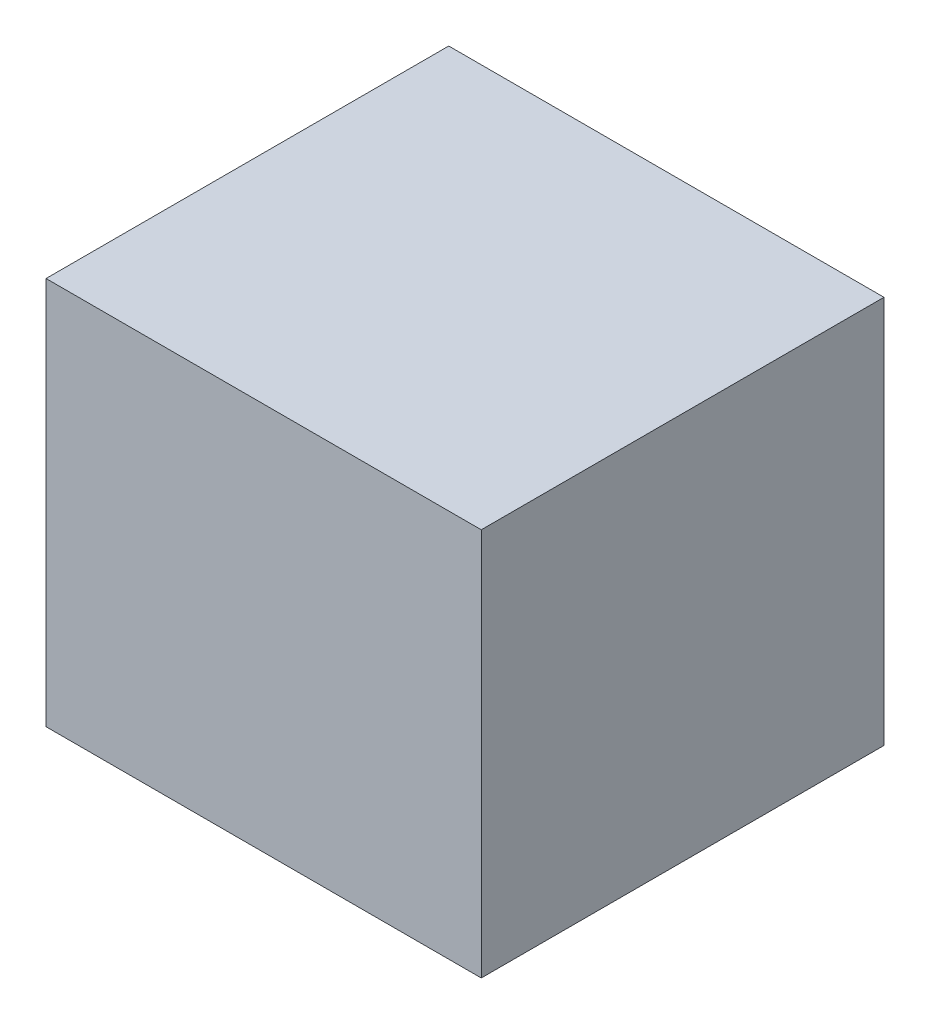
ISO-10303-21;
HEADER;
FILE_DESCRIPTION(('STEP AP214'),'2;1');
FILE_NAME('part.step','',(''),(''),'','','');
FILE_SCHEMA(('AUTOMOTIVE_DESIGN { 1 0 10303 214 1 1 1 1 }'));
ENDSEC;
DATA;
#1=APPLICATION_CONTEXT('core data for automotive mechanical design processes');
#2=APPLICATION_PROTOCOL_DEFINITION('international standard','automotive_design',2000,#1);
#3=PRODUCT_CONTEXT('',#1,'mechanical');
#4=PRODUCT('Part','Part','',(#3));
#5=PRODUCT_RELATED_PRODUCT_CATEGORY('part','',(#4));
#6=PRODUCT_DEFINITION_FORMATION('','',#4);
#7=PRODUCT_DEFINITION_CONTEXT('part definition',#1,'design');
#8=PRODUCT_DEFINITION('design','',#6,#7);
#9=PRODUCT_DEFINITION_SHAPE('','',#8);
#10=(LENGTH_UNIT() NAMED_UNIT(*) SI_UNIT(.MILLI.,.METRE.));
#11=(NAMED_UNIT(*) PLANE_ANGLE_UNIT() SI_UNIT($,.RADIAN.));
#12=(NAMED_UNIT(*) SI_UNIT($,.STERADIAN.) SOLID_ANGLE_UNIT());
#13=UNCERTAINTY_MEASURE_WITH_UNIT(LENGTH_MEASURE(1.E-05),#10,'distance_accuracy_value','');
#14=(GEOMETRIC_REPRESENTATION_CONTEXT(3) GLOBAL_UNCERTAINTY_ASSIGNED_CONTEXT((#13)) GLOBAL_UNIT_ASSIGNED_CONTEXT((#10,
#11,#12)) REPRESENTATION_CONTEXT('',''));
#15=CARTESIAN_POINT('',(0.,0.,0.));
#16=DIRECTION('',(0.,0.,1.));
#17=DIRECTION('',(1.,0.,0.));
#18=AXIS2_PLACEMENT_3D('',#15,#16,#17);
#19=CARTESIAN_POINT('',(-54.3543840375629,48.4782344118804,100.584));
#20=DIRECTION('',(1.,0.,0.));
#21=DIRECTION('',(0.,0.,-1.));
#22=AXIS2_PLACEMENT_3D('',#19,#20,#21);
#23=PLANE('',#22);
#24=DIRECTION('',(0.,-1.,0.));
#25=VECTOR('',#24,1.);
#26=CARTESIAN_POINT('',(-54.3543840375629,48.4782344118804,0.));
#27=LINE('',#26,#25);
#28=CARTESIAN_POINT('',(-54.3543840375629,48.4782344118804,0.));
#29=VERTEX_POINT('',#28);
#30=CARTESIAN_POINT('',(-54.3543840375629,-48.4782344118804,0.));
#31=VERTEX_POINT('',#30);
#32=EDGE_CURVE('E89',#29,#31,#27,.T.);
#33=ORIENTED_EDGE('',*,*,#32,.T.);
#34=DIRECTION('',(0.,0.,-1.));
#35=VECTOR('',#34,1.);
#36=CARTESIAN_POINT('',(-54.3543840375629,-48.4782344118804,100.584));
#37=LINE('',#36,#35);
#38=CARTESIAN_POINT('',(-54.3543840375629,-48.4782344118804,100.584));
#39=VERTEX_POINT('',#38);
#40=EDGE_CURVE('E46',#39,#31,#37,.T.);
#41=ORIENTED_EDGE('',*,*,#40,.F.);
#42=DIRECTION('',(0.,-1.,0.));
#43=VECTOR('',#42,1.);
#44=CARTESIAN_POINT('',(-54.3543840375629,48.4782344118804,100.584));
#45=LINE('',#44,#43);
#46=CARTESIAN_POINT('',(-54.3543840375629,48.4782344118804,100.584));
#47=VERTEX_POINT('',#46);
#48=EDGE_CURVE('E96',#47,#39,#45,.T.);
#49=ORIENTED_EDGE('',*,*,#48,.F.);
#50=DIRECTION('',(0.,0.,-1.));
#51=VECTOR('',#50,1.);
#52=CARTESIAN_POINT('',(-54.3543840375629,48.4782344118804,100.584));
#53=LINE('',#52,#51);
#54=EDGE_CURVE('E108',#47,#29,#53,.T.);
#55=ORIENTED_EDGE('',*,*,#54,.T.);
#56=EDGE_LOOP('',(#33,#41,#49,#55));
#57=FACE_BOUND('',#56,.T.);
#58=ADVANCED_FACE('F43',(#57),#23,.F.);
#59=CARTESIAN_POINT('',(54.3543840375629,-48.4782344118804,100.584));
#60=DIRECTION('',(0.,1.,0.));
#61=DIRECTION('',(0.,0.,1.));
#62=AXIS2_PLACEMENT_3D('',#59,#60,#61);
#63=PLANE('',#62);
#64=DIRECTION('',(1.,0.,0.));
#65=VECTOR('',#64,1.);
#66=CARTESIAN_POINT('',(54.3543840375629,-48.4782344118804,0.));
#67=LINE('',#66,#65);
#68=CARTESIAN_POINT('',(54.3543840375629,-48.4782344118804,0.));
#69=VERTEX_POINT('',#68);
#70=EDGE_CURVE('E78',#31,#69,#67,.T.);
#71=ORIENTED_EDGE('',*,*,#70,.T.);
#72=DIRECTION('',(0.,0.,-1.));
#73=VECTOR('',#72,1.);
#74=CARTESIAN_POINT('',(54.3543840375629,-48.4782344118804,100.584));
#75=LINE('',#74,#73);
#76=CARTESIAN_POINT('',(54.3543840375629,-48.4782344118804,100.584));
#77=VERTEX_POINT('',#76);
#78=EDGE_CURVE('E84',#77,#69,#75,.T.);
#79=ORIENTED_EDGE('',*,*,#78,.F.);
#80=DIRECTION('',(1.,0.,0.));
#81=VECTOR('',#80,1.);
#82=CARTESIAN_POINT('',(54.3543840375629,-48.4782344118804,100.584));
#83=LINE('',#82,#81);
#84=EDGE_CURVE('E99',#39,#77,#83,.T.);
#85=ORIENTED_EDGE('',*,*,#84,.F.);
#86=ORIENTED_EDGE('',*,*,#40,.T.);
#87=EDGE_LOOP('',(#71,#79,#85,#86));
#88=FACE_BOUND('',#87,.T.);
#89=ADVANCED_FACE('F83',(#88),#63,.F.);
#90=CARTESIAN_POINT('',(54.3543840375629,48.4782344118804,100.584));
#91=DIRECTION('',(-1.,0.,0.));
#92=DIRECTION('',(0.,0.,1.));
#93=AXIS2_PLACEMENT_3D('',#90,#91,#92);
#94=PLANE('',#93);
#95=DIRECTION('',(0.,1.,0.));
#96=VECTOR('',#95,1.);
#97=CARTESIAN_POINT('',(54.3543840375629,48.4782344118804,0.));
#98=LINE('',#97,#96);
#99=CARTESIAN_POINT('',(54.3543840375629,48.4782344118804,0.));
#100=VERTEX_POINT('',#99);
#101=EDGE_CURVE('E88',#69,#100,#98,.T.);
#102=ORIENTED_EDGE('',*,*,#101,.T.);
#103=DIRECTION('',(0.,0.,-1.));
#104=VECTOR('',#103,1.);
#105=CARTESIAN_POINT('',(54.3543840375629,48.4782344118804,100.584));
#106=LINE('',#105,#104);
#107=CARTESIAN_POINT('',(54.3543840375629,48.4782344118804,100.584));
#108=VERTEX_POINT('',#107);
#109=EDGE_CURVE('E12',#108,#100,#106,.T.);
#110=ORIENTED_EDGE('',*,*,#109,.F.);
#111=DIRECTION('',(0.,1.,0.));
#112=VECTOR('',#111,1.);
#113=CARTESIAN_POINT('',(54.3543840375629,48.4782344118804,100.584));
#114=LINE('',#113,#112);
#115=EDGE_CURVE('E94',#77,#108,#114,.T.);
#116=ORIENTED_EDGE('',*,*,#115,.F.);
#117=ORIENTED_EDGE('',*,*,#78,.T.);
#118=EDGE_LOOP('',(#102,#110,#116,#117));
#119=FACE_BOUND('',#118,.T.);
#120=ADVANCED_FACE('F92',(#119),#94,.F.);
#121=CARTESIAN_POINT('',(0.,0.,100.584));
#122=DIRECTION('',(0.,0.,-1.));
#123=DIRECTION('',(-1.,0.,0.));
#124=AXIS2_PLACEMENT_3D('',#121,#122,#123);
#125=PLANE('',#124);
#126=ORIENTED_EDGE('',*,*,#48,.T.);
#127=ORIENTED_EDGE('',*,*,#84,.T.);
#128=ORIENTED_EDGE('',*,*,#115,.T.);
#129=DIRECTION('',(-1.,0.,0.));
#130=VECTOR('',#129,1.);
#131=CARTESIAN_POINT('',(54.3543840375629,48.4782344118804,100.584));
#132=LINE('',#131,#130);
#133=EDGE_CURVE('E53',#108,#47,#132,.T.);
#134=ORIENTED_EDGE('',*,*,#133,.T.);
#135=EDGE_LOOP('',(#126,#127,#128,#134));
#136=FACE_BOUND('',#135,.T.);
#137=ADVANCED_FACE('F124',(#136),#125,.F.);
#138=CARTESIAN_POINT('',(0.,0.,0.));
#139=DIRECTION('',(0.,0.,-1.));
#140=DIRECTION('',(-1.,0.,0.));
#141=AXIS2_PLACEMENT_3D('',#138,#139,#140);
#142=PLANE('',#141);
#143=ORIENTED_EDGE('',*,*,#32,.F.);
#144=DIRECTION('',(-1.,0.,0.));
#145=VECTOR('',#144,1.);
#146=CARTESIAN_POINT('',(54.3543840375629,48.4782344118804,0.));
#147=LINE('',#146,#145);
#148=EDGE_CURVE('E62',#100,#29,#147,.T.);
#149=ORIENTED_EDGE('',*,*,#148,.F.);
#150=ORIENTED_EDGE('',*,*,#101,.F.);
#151=ORIENTED_EDGE('',*,*,#70,.F.);
#152=EDGE_LOOP('',(#143,#149,#150,#151));
#153=FACE_BOUND('',#152,.T.);
#154=ADVANCED_FACE('F95',(#153),#142,.T.);
#155=CARTESIAN_POINT('',(54.3543840375629,48.4782344118804,100.584));
#156=DIRECTION('',(0.,1.,0.));
#157=DIRECTION('',(0.,0.,1.));
#158=AXIS2_PLACEMENT_3D('',#155,#156,#157);
#159=PLANE('',#158);
#160=ORIENTED_EDGE('',*,*,#148,.T.);
#161=ORIENTED_EDGE('',*,*,#54,.F.);
#162=ORIENTED_EDGE('',*,*,#133,.F.);
#163=ORIENTED_EDGE('',*,*,#109,.T.);
#164=EDGE_LOOP('',(#160,#161,#162,#163));
#165=FACE_BOUND('',#164,.T.);
#166=ADVANCED_FACE('F118',(#165),#159,.T.);
#167=CLOSED_SHELL('',(#58,#89,#120,#137,#154,#166));
#168=MANIFOLD_SOLID_BREP('B2',#167);
#169=ADVANCED_BREP_SHAPE_REPRESENTATION('',(#18,#168),#14);
#170=SHAPE_DEFINITION_REPRESENTATION(#9,#169);
ENDSEC;
END-ISO-10303-21;
